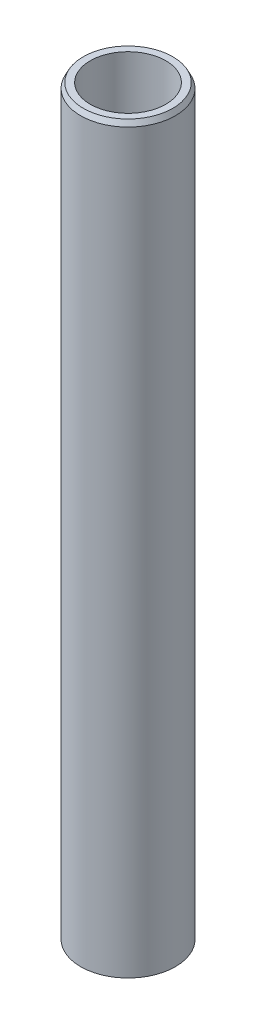
ISO-10303-21;
HEADER;
FILE_DESCRIPTION(('STEP AP214'),'2;1');
FILE_NAME('part.step','',(''),(''),'','','');
FILE_SCHEMA(('AUTOMOTIVE_DESIGN { 1 0 10303 214 1 1 1 1 }'));
ENDSEC;
DATA;
#1=APPLICATION_CONTEXT('core data for automotive mechanical design processes');
#2=APPLICATION_PROTOCOL_DEFINITION('international standard','automotive_design',2000,#1);
#3=PRODUCT_CONTEXT('',#1,'mechanical');
#4=PRODUCT('Part','Part','',(#3));
#5=PRODUCT_RELATED_PRODUCT_CATEGORY('part','',(#4));
#6=PRODUCT_DEFINITION_FORMATION('','',#4);
#7=PRODUCT_DEFINITION_CONTEXT('part definition',#1,'design');
#8=PRODUCT_DEFINITION('design','',#6,#7);
#9=PRODUCT_DEFINITION_SHAPE('','',#8);
#10=(LENGTH_UNIT() NAMED_UNIT(*) SI_UNIT(.MILLI.,.METRE.));
#11=(NAMED_UNIT(*) PLANE_ANGLE_UNIT() SI_UNIT($,.RADIAN.));
#12=(NAMED_UNIT(*) SI_UNIT($,.STERADIAN.) SOLID_ANGLE_UNIT());
#13=UNCERTAINTY_MEASURE_WITH_UNIT(LENGTH_MEASURE(1.E-05),#10,'distance_accuracy_value','');
#14=(GEOMETRIC_REPRESENTATION_CONTEXT(3) GLOBAL_UNCERTAINTY_ASSIGNED_CONTEXT((#13)) GLOBAL_UNIT_ASSIGNED_CONTEXT((#10,
#11,#12)) REPRESENTATION_CONTEXT('',''));
#15=CARTESIAN_POINT('',(0.,0.,0.));
#16=DIRECTION('',(0.,0.,1.));
#17=DIRECTION('',(1.,0.,0.));
#18=AXIS2_PLACEMENT_3D('',#15,#16,#17);
#19=CARTESIAN_POINT('',(0.,471.571712042853,0.));
#20=DIRECTION('',(0.,-1.,0.));
#21=DIRECTION('',(0.,0.,-1.));
#22=AXIS2_PLACEMENT_3D('',#19,#20,#21);
#23=CYLINDRICAL_SURFACE('',#22,30.);
#24=CARTESIAN_POINT('',(0.,468.334669866129,0.));
#25=DIRECTION('',(0.,1.,0.));
#26=DIRECTION('',(0.,0.,1.));
#27=AXIS2_PLACEMENT_3D('',#24,#25,#26);
#28=CIRCLE('',#27,30.);
#29=CARTESIAN_POINT('',(0.,468.334669866129,-30.));
#30=VERTEX_POINT('',#29);
#31=EDGE_CURVE('E50',#30,#30,#28,.F.);
#32=ORIENTED_EDGE('',*,*,#31,.T.);
#33=EDGE_LOOP('',(#32));
#34=FACE_BOUND('',#33,.T.);
#35=CARTESIAN_POINT('',(0.,1.66109714264434,0.));
#36=DIRECTION('',(0.,1.,0.));
#37=DIRECTION('',(0.,0.,1.));
#38=AXIS2_PLACEMENT_3D('',#35,#36,#37);
#39=CIRCLE('',#38,30.);
#40=CARTESIAN_POINT('',(0.,1.66109714264434,30.));
#41=VERTEX_POINT('',#40);
#42=EDGE_CURVE('E51',#41,#41,#39,.T.);
#43=ORIENTED_EDGE('',*,*,#42,.T.);
#44=EDGE_LOOP('',(#43));
#45=FACE_BOUND('',#44,.T.);
#46=ADVANCED_FACE('F39',(#34,#45),#23,.T.);
#47=CARTESIAN_POINT('',(0.,471.571712042853,0.));
#48=DIRECTION('',(0.,1.,0.));
#49=DIRECTION('',(0.,0.,1.));
#50=AXIS2_PLACEMENT_3D('',#47,#48,#49);
#51=PLANE('',#50);
#52=CARTESIAN_POINT('',(0.,471.571712042853,0.));
#53=DIRECTION('',(0.,1.,0.));
#54=DIRECTION('',(0.,0.,1.));
#55=AXIS2_PLACEMENT_3D('',#52,#53,#54);
#56=CIRCLE('',#55,28.3389028573557);
#57=CARTESIAN_POINT('',(0.,471.571712042853,-28.3389028573557));
#58=VERTEX_POINT('',#57);
#59=EDGE_CURVE('E54',#58,#58,#56,.T.);
#60=ORIENTED_EDGE('',*,*,#59,.T.);
#61=EDGE_LOOP('',(#60));
#62=FACE_BOUND('',#61,.T.);
#63=CARTESIAN_POINT('',(0.,471.571712042853,0.));
#64=DIRECTION('',(0.,1.,0.));
#65=DIRECTION('',(0.,0.,1.));
#66=AXIS2_PLACEMENT_3D('',#63,#64,#65);
#67=CIRCLE('',#66,23.9170977005536);
#68=CARTESIAN_POINT('',(0.,471.571712042853,23.9170977005536));
#69=VERTEX_POINT('',#68);
#70=EDGE_CURVE('E58',#69,#69,#67,.T.);
#71=ORIENTED_EDGE('',*,*,#70,.F.);
#72=EDGE_LOOP('',(#71));
#73=FACE_BOUND('',#72,.T.);
#74=ADVANCED_FACE('F69',(#62,#73),#51,.T.);
#75=CARTESIAN_POINT('',(0.,0.,0.));
#76=DIRECTION('',(0.,1.,0.));
#77=DIRECTION('',(0.,0.,1.));
#78=AXIS2_PLACEMENT_3D('',#75,#76,#77);
#79=PLANE('',#78);
#80=CARTESIAN_POINT('',(0.,0.,0.));
#81=DIRECTION('',(0.,1.,0.));
#82=DIRECTION('',(0.,0.,1.));
#83=AXIS2_PLACEMENT_3D('',#80,#81,#82);
#84=CIRCLE('',#83,26.7629578232759);
#85=CARTESIAN_POINT('',(0.,0.,26.7629578232759));
#86=VERTEX_POINT('',#85);
#87=EDGE_CURVE('E10',#86,#86,#84,.F.);
#88=ORIENTED_EDGE('',*,*,#87,.T.);
#89=EDGE_LOOP('',(#88));
#90=FACE_BOUND('',#89,.T.);
#91=CARTESIAN_POINT('',(0.,0.,0.));
#92=DIRECTION('',(0.,1.,0.));
#93=DIRECTION('',(0.,0.,1.));
#94=AXIS2_PLACEMENT_3D('',#91,#92,#93);
#95=CIRCLE('',#94,23.9170977005536);
#96=CARTESIAN_POINT('',(0.,0.,23.9170977005536));
#97=VERTEX_POINT('',#96);
#98=EDGE_CURVE('E63',#97,#97,#95,.T.);
#99=ORIENTED_EDGE('',*,*,#98,.T.);
#100=EDGE_LOOP('',(#99));
#101=FACE_BOUND('',#100,.T.);
#102=ADVANCED_FACE('F75',(#90,#101),#79,.F.);
#103=CARTESIAN_POINT('',(0.,471.571712042853,0.));
#104=DIRECTION('',(0.,-1.,0.));
#105=DIRECTION('',(0.,0.,-1.));
#106=AXIS2_PLACEMENT_3D('',#103,#104,#105);
#107=CYLINDRICAL_SURFACE('',#106,23.9170977005536);
#108=ORIENTED_EDGE('',*,*,#70,.T.);
#109=EDGE_LOOP('',(#108));
#110=FACE_BOUND('',#109,.T.);
#111=ORIENTED_EDGE('',*,*,#98,.F.);
#112=EDGE_LOOP('',(#111));
#113=FACE_BOUND('',#112,.T.);
#114=ADVANCED_FACE('F70',(#110,#113),#107,.F.);
#115=CARTESIAN_POINT('',(0.,471.571712042853,0.));
#116=DIRECTION('',(0.,-1.,0.));
#117=DIRECTION('',(0.,0.,-1.));
#118=AXIS2_PLACEMENT_3D('',#115,#116,#117);
#119=CONICAL_SURFACE('',#118,28.3389028573557,0.474114369825272);
#120=CARTESIAN_POINT('',(0.,468.334669866129,-30.));
#121=CARTESIAN_POINT('',(0.,468.36838905547,-29.9826969047641));
#122=CARTESIAN_POINT('',(0.,468.402108244811,-29.9653938095283));
#123=CARTESIAN_POINT('',(0.,468.469546623492,-29.9307876190565));
#124=CARTESIAN_POINT('',(0.,468.503265812833,-29.9134845238206));
#125=CARTESIAN_POINT('',(0.,468.570704191515,-29.8788783333489));
#126=CARTESIAN_POINT('',(0.,468.604423380856,-29.861575238113));
#127=CARTESIAN_POINT('',(0.,468.671861759538,-29.8269690476412));
#128=CARTESIAN_POINT('',(0.,468.705580948878,-29.8096659524053));
#129=CARTESIAN_POINT('',(0.,468.77301932756,-29.7750597619336));
#130=CARTESIAN_POINT('',(0.,468.806738516901,-29.7577566666977));
#131=CARTESIAN_POINT('',(0.,468.874176895583,-29.723150476226));
#132=CARTESIAN_POINT('',(0.,468.907896084924,-29.7058473809901));
#133=CARTESIAN_POINT('',(0.,468.975334463605,-29.6712411905183));
#134=CARTESIAN_POINT('',(0.,469.009053652946,-29.6539380952824));
#135=CARTESIAN_POINT('',(0.,469.076492031628,-29.6193319048107));
#136=CARTESIAN_POINT('',(0.,469.110211220969,-29.6020288095748));
#137=CARTESIAN_POINT('',(0.,469.177649599651,-29.5674226191031));
#138=CARTESIAN_POINT('',(0.,469.211368788992,-29.5501195238672));
#139=CARTESIAN_POINT('',(0.,469.278807167673,-29.5155133333954));
#140=CARTESIAN_POINT('',(0.,469.312526357014,-29.4982102381595));
#141=CARTESIAN_POINT('',(0.,469.379964735696,-29.4636040476878));
#142=CARTESIAN_POINT('',(0.,469.413683925037,-29.4463009524519));
#143=CARTESIAN_POINT('',(0.,469.481122303719,-29.4116947619801));
#144=CARTESIAN_POINT('',(0.,469.514841493059,-29.3943916667443));
#145=CARTESIAN_POINT('',(0.,469.582279871741,-29.3597854762725));
#146=CARTESIAN_POINT('',(0.,469.615999061082,-29.3424823810366));
#147=CARTESIAN_POINT('',(0.,469.683437439764,-29.3078761905649));
#148=CARTESIAN_POINT('',(0.,469.717156629105,-29.290573095329));
#149=CARTESIAN_POINT('',(0.,469.784595007786,-29.2559669048572));
#150=CARTESIAN_POINT('',(0.,469.818314197127,-29.2386638096214));
#151=CARTESIAN_POINT('',(0.,469.885752575809,-29.2040576191496));
#152=CARTESIAN_POINT('',(0.,469.91947176515,-29.1867545239137));
#153=CARTESIAN_POINT('',(0.,469.986910143832,-29.152148333442));
#154=CARTESIAN_POINT('',(0.,470.020629333173,-29.1348452382061));
#155=CARTESIAN_POINT('',(0.,470.088067711854,-29.1002390477343));
#156=CARTESIAN_POINT('',(0.,470.121786901195,-29.0829359524984));
#157=CARTESIAN_POINT('',(0.,470.189225279877,-29.0483297620267));
#158=CARTESIAN_POINT('',(0.,470.222944469218,-29.0310266667908));
#159=CARTESIAN_POINT('',(0.,470.2903828479,-28.9964204763191));
#160=CARTESIAN_POINT('',(0.,470.32410203724,-28.9791173810832));
#161=CARTESIAN_POINT('',(0.,470.391540415922,-28.9445111906114));
#162=CARTESIAN_POINT('',(0.,470.425259605263,-28.9272080953755));
#163=CARTESIAN_POINT('',(0.,470.492697983945,-28.8926019049038));
#164=CARTESIAN_POINT('',(0.,470.526417173286,-28.8752988096679));
#165=CARTESIAN_POINT('',(0.,470.593855551967,-28.8406926191962));
#166=CARTESIAN_POINT('',(0.,470.627574741308,-28.8233895239603));
#167=CARTESIAN_POINT('',(0.,470.69501311999,-28.7887833334885));
#168=CARTESIAN_POINT('',(0.,470.728732309331,-28.7714802382526));
#169=CARTESIAN_POINT('',(0.,470.796170688013,-28.7368740477809));
#170=CARTESIAN_POINT('',(0.,470.829889877354,-28.719570952545));
#171=CARTESIAN_POINT('',(0.,470.897328256035,-28.6849647620732));
#172=CARTESIAN_POINT('',(0.,470.931047445376,-28.6676616668374));
#173=CARTESIAN_POINT('',(0.,470.998485824058,-28.6330554763656));
#174=CARTESIAN_POINT('',(0.,471.032205013399,-28.6157523811297));
#175=CARTESIAN_POINT('',(0.,471.099643392081,-28.581146190658));
#176=CARTESIAN_POINT('',(0.,471.133362581422,-28.5638430954221));
#177=CARTESIAN_POINT('',(0.,471.200800960103,-28.5292369049503));
#178=CARTESIAN_POINT('',(0.,471.234520149444,-28.5119338097145));
#179=CARTESIAN_POINT('',(0.,471.301958528126,-28.4773276192427));
#180=CARTESIAN_POINT('',(0.,471.335677717467,-28.4600245240068));
#181=CARTESIAN_POINT('',(0.,471.403116096148,-28.4254183335351));
#182=CARTESIAN_POINT('',(0.,471.436835285489,-28.4081152382992));
#183=CARTESIAN_POINT('',(0.,471.504273664171,-28.3735090478274));
#184=CARTESIAN_POINT('',(0.,471.537992853512,-28.3562059525916));
#185=CARTESIAN_POINT('',(0.,471.571712042853,-28.3389028573557));
#186=B_SPLINE_CURVE_WITH_KNOTS('',3,(#120,#121,#122,#123,#124,#125,#126,#127,#128,#129,#130,
#131,#132,#133,#134,#135,#136,#137,#138,#139,#140,#141,#142,#143,#144,#145,#146,#147,#148,#149,
#150,#151,#152,#153,#154,#155,#156,#157,#158,#159,#160,#161,#162,#163,#164,#165,#166,#167,#168,
#169,#170,#171,#172,#173,#174,#175,#176,#177,#178,#179,#180,#181,#182,#183,#184,#185),
.UNSPECIFIED.,.F.,.F.,(4,2,2,2,2,2,2,2,2,2,2,2,2,2,2,2,2,2,2,2,2,2,2,2,2,2,2,2,2,2,2,2,4),(0.,
0.113698845688658,0.227397691377318,0.341096537065926,0.454795382754586,0.568494228443244,
0.682193074131854,0.795891919820513,0.909590765509172,1.02328961119778,1.13698845688644,
1.2506873025751,1.36438614826371,1.47808499395237,1.59178383964103,1.70548268532964,
1.8191815310183,1.93288037670695,2.04657922239556,2.16027806808422,2.27397691377288,
2.38767575946149,2.50137460515015,2.61507345083881,2.72877229652742,2.84247114221608,
2.95616998790474,3.06986883359335,3.183567679282,3.29726652497066,3.41096537065927,
3.52466421634793,3.63836306203659),.UNSPECIFIED.);
#187=EDGE_CURVE('BSEAM81',#30,#58,#186,.T.);
#188=ORIENTED_EDGE('',*,*,#31,.F.);
#189=ORIENTED_EDGE('',*,*,#59,.F.);
#190=ORIENTED_EDGE('',*,*,#187,.T.);
#191=ORIENTED_EDGE('',*,*,#187,.F.);
#192=EDGE_LOOP('',(#188,#190,#189,#191));
#193=FACE_BOUND('',#192,.T.);
#194=ADVANCED_FACE('F81',(#193),#119,.T.);
#195=CARTESIAN_POINT('',(0.,1.66109714264434,0.));
#196=DIRECTION('',(0.,1.,0.));
#197=DIRECTION('',(0.,0.,1.));
#198=AXIS2_PLACEMENT_3D('',#195,#196,#197);
#199=CONICAL_SURFACE('',#198,30.,1.09668195696963);
#200=ORIENTED_EDGE('',*,*,#87,.F.);
#201=EDGE_LOOP('',(#200));
#202=FACE_BOUND('',#201,.T.);
#203=ORIENTED_EDGE('',*,*,#42,.F.);
#204=EDGE_LOOP('',(#203));
#205=FACE_BOUND('',#204,.T.);
#206=ADVANCED_FACE('F45',(#202,#205),#199,.T.);
#207=CLOSED_SHELL('',(#46,#74,#102,#114,#194,#206));
#208=MANIFOLD_SOLID_BREP('B2',#207);
#209=ADVANCED_BREP_SHAPE_REPRESENTATION('',(#18,#208),#14);
#210=SHAPE_DEFINITION_REPRESENTATION(#9,#209);
ENDSEC;
END-ISO-10303-21;
